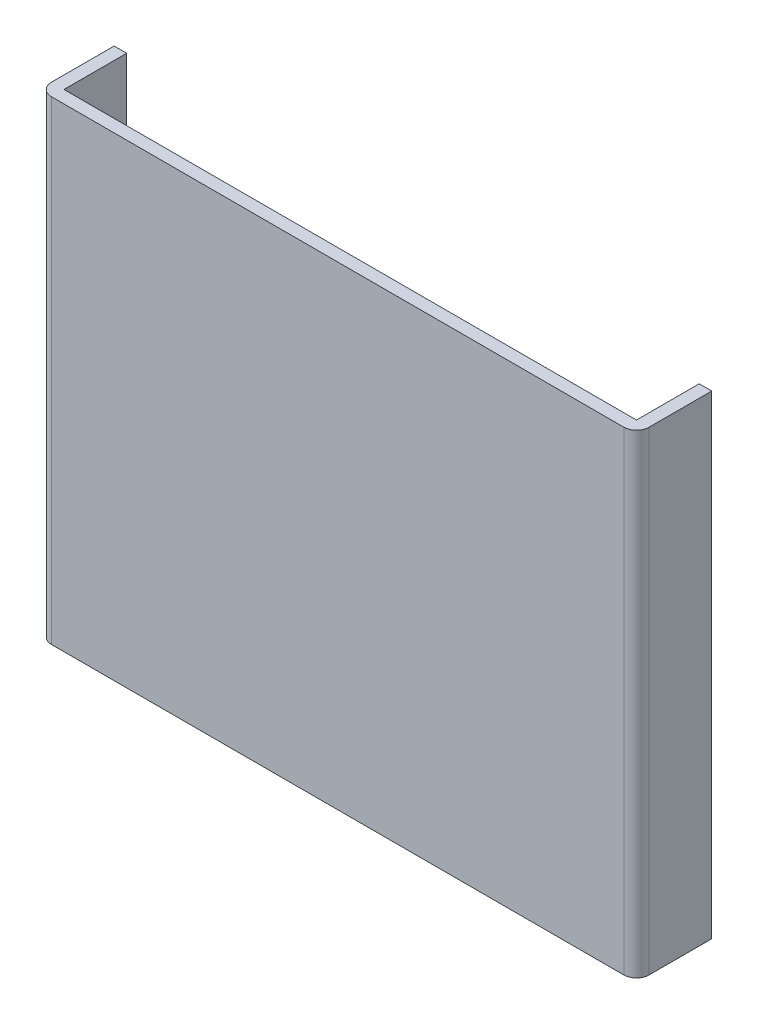
ISO-10303-21;
HEADER;
FILE_DESCRIPTION(('STEP AP214'),'2;1');
FILE_NAME('part.step','',(''),(''),'','','');
FILE_SCHEMA(('AUTOMOTIVE_DESIGN { 1 0 10303 214 1 1 1 1 }'));
ENDSEC;
DATA;
#1=APPLICATION_CONTEXT('core data for automotive mechanical design processes');
#2=APPLICATION_PROTOCOL_DEFINITION('international standard','automotive_design',2000,#1);
#3=PRODUCT_CONTEXT('',#1,'mechanical');
#4=PRODUCT('Part','Part','',(#3));
#5=PRODUCT_RELATED_PRODUCT_CATEGORY('part','',(#4));
#6=PRODUCT_DEFINITION_FORMATION('','',#4);
#7=PRODUCT_DEFINITION_CONTEXT('part definition',#1,'design');
#8=PRODUCT_DEFINITION('design','',#6,#7);
#9=PRODUCT_DEFINITION_SHAPE('','',#8);
#10=(LENGTH_UNIT() NAMED_UNIT(*) SI_UNIT(.MILLI.,.METRE.));
#11=(NAMED_UNIT(*) PLANE_ANGLE_UNIT() SI_UNIT($,.RADIAN.));
#12=(NAMED_UNIT(*) SI_UNIT($,.STERADIAN.) SOLID_ANGLE_UNIT());
#13=UNCERTAINTY_MEASURE_WITH_UNIT(LENGTH_MEASURE(1.E-05),#10,'distance_accuracy_value','');
#14=(GEOMETRIC_REPRESENTATION_CONTEXT(3) GLOBAL_UNCERTAINTY_ASSIGNED_CONTEXT((#13)) GLOBAL_UNIT_ASSIGNED_CONTEXT((#10,
#11,#12)) REPRESENTATION_CONTEXT('',''));
#15=CARTESIAN_POINT('',(0.,0.,0.));
#16=DIRECTION('',(0.,0.,1.));
#17=DIRECTION('',(1.,0.,0.));
#18=AXIS2_PLACEMENT_3D('',#15,#16,#17);
#19=CARTESIAN_POINT('',(-16.6010771137425,75.62,3.56350979413361));
#20=DIRECTION('',(0.,0.,1.));
#21=DIRECTION('',(1.,0.,0.));
#22=AXIS2_PLACEMENT_3D('',#19,#20,#21);
#23=PLANE('',#22);
#24=DIRECTION('',(-1.,0.,0.));
#25=VECTOR('',#24,1.);
#26=CARTESIAN_POINT('',(-16.6010771137425,0.,3.56350979413361));
#27=LINE('',#26,#25);
#28=CARTESIAN_POINT('',(-16.6010771137425,0.,3.56350979413361));
#29=VERTEX_POINT('',#28);
#30=CARTESIAN_POINT('',(-18.6010771137425,0.,3.56350979413361));
#31=VERTEX_POINT('',#30);
#32=EDGE_CURVE('E130',#29,#31,#27,.T.);
#33=ORIENTED_EDGE('',*,*,#32,.T.);
#34=DIRECTION('',(0.,-1.,0.));
#35=VECTOR('',#34,1.);
#36=CARTESIAN_POINT('',(-18.6010771137425,75.62,3.56350979413361));
#37=LINE('',#36,#35);
#38=CARTESIAN_POINT('',(-18.6010771137425,75.62,3.56350979413361));
#39=VERTEX_POINT('',#38);
#40=EDGE_CURVE('E113',#39,#31,#37,.T.);
#41=ORIENTED_EDGE('',*,*,#40,.F.);
#42=DIRECTION('',(-1.,0.,0.));
#43=VECTOR('',#42,1.);
#44=CARTESIAN_POINT('',(-16.6010771137425,75.62,3.56350979413361));
#45=LINE('',#44,#43);
#46=CARTESIAN_POINT('',(-16.6010771137425,75.62,3.56350979413361));
#47=VERTEX_POINT('',#46);
#48=EDGE_CURVE('E118',#47,#39,#45,.T.);
#49=ORIENTED_EDGE('',*,*,#48,.F.);
#50=DIRECTION('',(0.,-1.,0.));
#51=VECTOR('',#50,1.);
#52=CARTESIAN_POINT('',(-16.6010771137425,75.62,3.56350979413361));
#53=LINE('',#52,#51);
#54=EDGE_CURVE('E184',#47,#29,#53,.T.);
#55=ORIENTED_EDGE('',*,*,#54,.T.);
#56=EDGE_LOOP('',(#33,#41,#49,#55));
#57=FACE_BOUND('',#56,.T.);
#58=ADVANCED_FACE('F33',(#57),#23,.F.);
#59=CARTESIAN_POINT('',(-18.6010771137425,75.62,3.56350979413361));
#60=DIRECTION('',(1.,0.,0.));
#61=DIRECTION('',(0.,0.,-1.));
#62=AXIS2_PLACEMENT_3D('',#59,#60,#61);
#63=PLANE('',#62);
#64=DIRECTION('',(0.,0.,1.));
#65=VECTOR('',#64,1.);
#66=CARTESIAN_POINT('',(-18.6010771137425,0.,3.56350979413361));
#67=LINE('',#66,#65);
#68=CARTESIAN_POINT('',(-18.6010771137425,0.,13.5635097941336));
#69=VERTEX_POINT('',#68);
#70=EDGE_CURVE('E171',#31,#69,#67,.T.);
#71=ORIENTED_EDGE('',*,*,#70,.T.);
#72=DIRECTION('',(0.,-1.,0.));
#73=VECTOR('',#72,1.);
#74=CARTESIAN_POINT('',(-18.6010771137425,75.62,13.5635097941336));
#75=LINE('',#74,#73);
#76=CARTESIAN_POINT('',(-18.6010771137425,75.62,13.5635097941336));
#77=VERTEX_POINT('',#76);
#78=EDGE_CURVE('E11',#69,#77,#75,.F.);
#79=ORIENTED_EDGE('',*,*,#78,.T.);
#80=DIRECTION('',(0.,0.,1.));
#81=VECTOR('',#80,1.);
#82=CARTESIAN_POINT('',(-18.6010771137425,75.62,3.56350979413361));
#83=LINE('',#82,#81);
#84=EDGE_CURVE('E109',#39,#77,#83,.T.);
#85=ORIENTED_EDGE('',*,*,#84,.F.);
#86=ORIENTED_EDGE('',*,*,#40,.T.);
#87=EDGE_LOOP('',(#71,#79,#85,#86));
#88=FACE_BOUND('',#87,.T.);
#89=ADVANCED_FACE('F111',(#88),#63,.F.);
#90=CARTESIAN_POINT('',(-18.6010771137425,75.62,15.5635097941336));
#91=DIRECTION('',(0.,0.,-1.));
#92=DIRECTION('',(-1.,0.,0.));
#93=AXIS2_PLACEMENT_3D('',#90,#91,#92);
#94=PLANE('',#93);
#95=DIRECTION('',(1.,0.,0.));
#96=VECTOR('',#95,1.);
#97=CARTESIAN_POINT('',(-18.6010771137425,0.,15.5635097941336));
#98=LINE('',#97,#96);
#99=CARTESIAN_POINT('',(-16.6010771137425,0.,15.5635097941336));
#100=VERTEX_POINT('',#99);
#101=CARTESIAN_POINT('',(74.6589228862575,0.,15.5635097941336));
#102=VERTEX_POINT('',#101);
#103=EDGE_CURVE('E166',#100,#102,#98,.T.);
#104=ORIENTED_EDGE('',*,*,#103,.T.);
#105=DIRECTION('',(0.,-1.,0.));
#106=VECTOR('',#105,1.);
#107=CARTESIAN_POINT('',(74.6589228862575,75.62,15.5635097941336));
#108=LINE('',#107,#106);
#109=CARTESIAN_POINT('',(74.6589228862575,75.62,15.5635097941336));
#110=VERTEX_POINT('',#109);
#111=EDGE_CURVE('E54',#102,#110,#108,.F.);
#112=ORIENTED_EDGE('',*,*,#111,.T.);
#113=DIRECTION('',(1.,0.,0.));
#114=VECTOR('',#113,1.);
#115=CARTESIAN_POINT('',(-18.6010771137425,75.62,15.5635097941336));
#116=LINE('',#115,#114);
#117=CARTESIAN_POINT('',(-16.6010771137425,75.62,15.5635097941336));
#118=VERTEX_POINT('',#117);
#119=EDGE_CURVE('E117',#118,#110,#116,.T.);
#120=ORIENTED_EDGE('',*,*,#119,.F.);
#121=DIRECTION('',(0.,-1.,0.));
#122=VECTOR('',#121,1.);
#123=CARTESIAN_POINT('',(-16.6010771137425,75.62,15.5635097941336));
#124=LINE('',#123,#122);
#125=EDGE_CURVE('E145',#118,#100,#124,.T.);
#126=ORIENTED_EDGE('',*,*,#125,.T.);
#127=EDGE_LOOP('',(#104,#112,#120,#126));
#128=FACE_BOUND('',#127,.T.);
#129=ADVANCED_FACE('F169',(#128),#94,.F.);
#130=CARTESIAN_POINT('',(76.6589228862575,75.62,15.5635097941336));
#131=DIRECTION('',(-1.,0.,0.));
#132=DIRECTION('',(0.,0.,1.));
#133=AXIS2_PLACEMENT_3D('',#130,#131,#132);
#134=PLANE('',#133);
#135=DIRECTION('',(0.,0.,-1.));
#136=VECTOR('',#135,1.);
#137=CARTESIAN_POINT('',(76.6589228862575,75.62,15.5635097941336));
#138=LINE('',#137,#136);
#139=CARTESIAN_POINT('',(76.6589228862575,75.62,13.5635097941336));
#140=VERTEX_POINT('',#139);
#141=CARTESIAN_POINT('',(76.6589228862575,75.62,3.5635097941336));
#142=VERTEX_POINT('',#141);
#143=EDGE_CURVE('E152',#140,#142,#138,.T.);
#144=ORIENTED_EDGE('',*,*,#143,.F.);
#145=DIRECTION('',(0.,-1.,0.));
#146=VECTOR('',#145,1.);
#147=CARTESIAN_POINT('',(76.6589228862575,75.62,13.5635097941336));
#148=LINE('',#147,#146);
#149=CARTESIAN_POINT('',(76.6589228862575,0.,13.5635097941336));
#150=VERTEX_POINT('',#149);
#151=EDGE_CURVE('E131',#140,#150,#148,.T.);
#152=ORIENTED_EDGE('',*,*,#151,.T.);
#153=DIRECTION('',(0.,0.,-1.));
#154=VECTOR('',#153,1.);
#155=CARTESIAN_POINT('',(76.6589228862575,0.,15.5635097941336));
#156=LINE('',#155,#154);
#157=CARTESIAN_POINT('',(76.6589228862575,0.,3.5635097941336));
#158=VERTEX_POINT('',#157);
#159=EDGE_CURVE('E168',#150,#158,#156,.T.);
#160=ORIENTED_EDGE('',*,*,#159,.T.);
#161=DIRECTION('',(0.,-1.,0.));
#162=VECTOR('',#161,1.);
#163=CARTESIAN_POINT('',(76.6589228862575,75.62,3.5635097941336));
#164=LINE('',#163,#162);
#165=EDGE_CURVE('E132',#142,#158,#164,.T.);
#166=ORIENTED_EDGE('',*,*,#165,.F.);
#167=EDGE_LOOP('',(#144,#152,#160,#166));
#168=FACE_BOUND('',#167,.T.);
#169=ADVANCED_FACE('F157',(#168),#134,.F.);
#170=CARTESIAN_POINT('',(76.6589228862575,75.62,3.5635097941336));
#171=DIRECTION('',(0.,0.,1.));
#172=DIRECTION('',(1.,0.,0.));
#173=AXIS2_PLACEMENT_3D('',#170,#171,#172);
#174=PLANE('',#173);
#175=DIRECTION('',(-1.,0.,0.));
#176=VECTOR('',#175,1.);
#177=CARTESIAN_POINT('',(76.6589228862575,0.,3.5635097941336));
#178=LINE('',#177,#176);
#179=CARTESIAN_POINT('',(74.6589228862575,0.,3.5635097941336));
#180=VERTEX_POINT('',#179);
#181=EDGE_CURVE('E173',#158,#180,#178,.T.);
#182=ORIENTED_EDGE('',*,*,#181,.T.);
#183=DIRECTION('',(0.,-1.,0.));
#184=VECTOR('',#183,1.);
#185=CARTESIAN_POINT('',(74.6589228862575,75.62,3.5635097941336));
#186=LINE('',#185,#184);
#187=CARTESIAN_POINT('',(74.6589228862575,75.62,3.5635097941336));
#188=VERTEX_POINT('',#187);
#189=EDGE_CURVE('E138',#188,#180,#186,.T.);
#190=ORIENTED_EDGE('',*,*,#189,.F.);
#191=DIRECTION('',(-1.,0.,0.));
#192=VECTOR('',#191,1.);
#193=CARTESIAN_POINT('',(76.6589228862575,75.62,3.5635097941336));
#194=LINE('',#193,#192);
#195=EDGE_CURVE('E160',#142,#188,#194,.T.);
#196=ORIENTED_EDGE('',*,*,#195,.F.);
#197=ORIENTED_EDGE('',*,*,#165,.T.);
#198=EDGE_LOOP('',(#182,#190,#196,#197));
#199=FACE_BOUND('',#198,.T.);
#200=ADVANCED_FACE('F214',(#199),#174,.F.);
#201=CARTESIAN_POINT('',(74.6589228862575,75.62,3.5635097941336));
#202=DIRECTION('',(1.,0.,0.));
#203=DIRECTION('',(0.,0.,-1.));
#204=AXIS2_PLACEMENT_3D('',#201,#202,#203);
#205=PLANE('',#204);
#206=DIRECTION('',(0.,0.,1.));
#207=VECTOR('',#206,1.);
#208=CARTESIAN_POINT('',(74.6589228862575,0.,3.5635097941336));
#209=LINE('',#208,#207);
#210=CARTESIAN_POINT('',(74.6589228862575,0.,13.5635097941336));
#211=VERTEX_POINT('',#210);
#212=EDGE_CURVE('E179',#180,#211,#209,.T.);
#213=ORIENTED_EDGE('',*,*,#212,.T.);
#214=DIRECTION('',(0.,-1.,0.));
#215=VECTOR('',#214,1.);
#216=CARTESIAN_POINT('',(74.6589228862575,75.62,13.5635097941336));
#217=LINE('',#216,#215);
#218=CARTESIAN_POINT('',(74.6589228862575,75.62,13.5635097941336));
#219=VERTEX_POINT('',#218);
#220=EDGE_CURVE('E189',#219,#211,#217,.T.);
#221=ORIENTED_EDGE('',*,*,#220,.F.);
#222=DIRECTION('',(0.,0.,1.));
#223=VECTOR('',#222,1.);
#224=CARTESIAN_POINT('',(74.6589228862575,75.62,3.5635097941336));
#225=LINE('',#224,#223);
#226=EDGE_CURVE('E198',#188,#219,#225,.T.);
#227=ORIENTED_EDGE('',*,*,#226,.F.);
#228=ORIENTED_EDGE('',*,*,#189,.T.);
#229=EDGE_LOOP('',(#213,#221,#227,#228));
#230=FACE_BOUND('',#229,.T.);
#231=ADVANCED_FACE('F196',(#230),#205,.F.);
#232=CARTESIAN_POINT('',(74.6589228862575,75.62,13.5635097941336));
#233=DIRECTION('',(0.,0.,1.));
#234=DIRECTION('',(1.,0.,0.));
#235=AXIS2_PLACEMENT_3D('',#232,#233,#234);
#236=PLANE('',#235);
#237=DIRECTION('',(-1.,0.,0.));
#238=VECTOR('',#237,1.);
#239=CARTESIAN_POINT('',(74.6589228862575,0.,13.5635097941336));
#240=LINE('',#239,#238);
#241=CARTESIAN_POINT('',(-16.6010771137425,0.,13.5635097941336));
#242=VERTEX_POINT('',#241);
#243=EDGE_CURVE('E181',#211,#242,#240,.T.);
#244=ORIENTED_EDGE('',*,*,#243,.T.);
#245=DIRECTION('',(0.,-1.,0.));
#246=VECTOR('',#245,1.);
#247=CARTESIAN_POINT('',(-16.6010771137425,75.62,13.5635097941336));
#248=LINE('',#247,#246);
#249=CARTESIAN_POINT('',(-16.6010771137425,75.62,13.5635097941336));
#250=VERTEX_POINT('',#249);
#251=EDGE_CURVE('E186',#250,#242,#248,.T.);
#252=ORIENTED_EDGE('',*,*,#251,.F.);
#253=DIRECTION('',(-1.,0.,0.));
#254=VECTOR('',#253,1.);
#255=CARTESIAN_POINT('',(74.6589228862575,75.62,13.5635097941336));
#256=LINE('',#255,#254);
#257=EDGE_CURVE('E208',#219,#250,#256,.T.);
#258=ORIENTED_EDGE('',*,*,#257,.F.);
#259=ORIENTED_EDGE('',*,*,#220,.T.);
#260=EDGE_LOOP('',(#244,#252,#258,#259));
#261=FACE_BOUND('',#260,.T.);
#262=ADVANCED_FACE('F204',(#261),#236,.F.);
#263=CARTESIAN_POINT('',(-16.6010771137425,75.62,13.5635097941336));
#264=DIRECTION('',(-1.,0.,0.));
#265=DIRECTION('',(0.,0.,1.));
#266=AXIS2_PLACEMENT_3D('',#263,#264,#265);
#267=PLANE('',#266);
#268=DIRECTION('',(0.,0.,-1.));
#269=VECTOR('',#268,1.);
#270=CARTESIAN_POINT('',(-16.6010771137425,0.,13.5635097941336));
#271=LINE('',#270,#269);
#272=EDGE_CURVE('E127',#242,#29,#271,.T.);
#273=ORIENTED_EDGE('',*,*,#272,.T.);
#274=ORIENTED_EDGE('',*,*,#54,.F.);
#275=DIRECTION('',(0.,0.,-1.));
#276=VECTOR('',#275,1.);
#277=CARTESIAN_POINT('',(-16.6010771137425,75.62,13.5635097941336));
#278=LINE('',#277,#276);
#279=EDGE_CURVE('E123',#250,#47,#278,.T.);
#280=ORIENTED_EDGE('',*,*,#279,.F.);
#281=ORIENTED_EDGE('',*,*,#251,.T.);
#282=EDGE_LOOP('',(#273,#274,#280,#281));
#283=FACE_BOUND('',#282,.T.);
#284=ADVANCED_FACE('F207',(#283),#267,.F.);
#285=CARTESIAN_POINT('',(0.,75.62,0.));
#286=DIRECTION('',(0.,1.,0.));
#287=DIRECTION('',(0.,0.,1.));
#288=AXIS2_PLACEMENT_3D('',#285,#286,#287);
#289=PLANE('',#288);
#290=ORIENTED_EDGE('',*,*,#119,.T.);
#291=CARTESIAN_POINT('',(74.6589228862575,75.62,13.5635097941336));
#292=DIRECTION('',(0.,1.,0.));
#293=DIRECTION('',(0.,0.,1.));
#294=AXIS2_PLACEMENT_3D('',#291,#292,#293);
#295=CIRCLE('',#294,2.);
#296=EDGE_CURVE('E41',#110,#140,#295,.T.);
#297=ORIENTED_EDGE('',*,*,#296,.T.);
#298=ORIENTED_EDGE('',*,*,#143,.T.);
#299=ORIENTED_EDGE('',*,*,#195,.T.);
#300=ORIENTED_EDGE('',*,*,#226,.T.);
#301=ORIENTED_EDGE('',*,*,#257,.T.);
#302=ORIENTED_EDGE('',*,*,#279,.T.);
#303=ORIENTED_EDGE('',*,*,#48,.T.);
#304=ORIENTED_EDGE('',*,*,#84,.T.);
#305=CARTESIAN_POINT('',(-16.6010771137425,75.62,13.5635097941336));
#306=DIRECTION('',(0.,1.,0.));
#307=DIRECTION('',(0.,0.,1.));
#308=AXIS2_PLACEMENT_3D('',#305,#306,#307);
#309=CIRCLE('',#308,2.);
#310=EDGE_CURVE('E149',#77,#118,#309,.T.);
#311=ORIENTED_EDGE('',*,*,#310,.T.);
#312=EDGE_LOOP('',(#290,#297,#298,#299,#300,#301,#302,#303,#304,#311));
#313=FACE_BOUND('',#312,.T.);
#314=ADVANCED_FACE('F121',(#313),#289,.T.);
#315=CARTESIAN_POINT('',(0.,0.,0.));
#316=DIRECTION('',(0.,1.,0.));
#317=DIRECTION('',(0.,0.,1.));
#318=AXIS2_PLACEMENT_3D('',#315,#316,#317);
#319=PLANE('',#318);
#320=ORIENTED_EDGE('',*,*,#159,.F.);
#321=CARTESIAN_POINT('',(74.6589228862575,0.,13.5635097941336));
#322=DIRECTION('',(0.,1.,0.));
#323=DIRECTION('',(0.,0.,1.));
#324=AXIS2_PLACEMENT_3D('',#321,#322,#323);
#325=CIRCLE('',#324,2.);
#326=EDGE_CURVE('E143',#150,#102,#325,.F.);
#327=ORIENTED_EDGE('',*,*,#326,.T.);
#328=ORIENTED_EDGE('',*,*,#103,.F.);
#329=CARTESIAN_POINT('',(-16.6010771137425,0.,13.5635097941336));
#330=DIRECTION('',(0.,1.,0.));
#331=DIRECTION('',(0.,0.,1.));
#332=AXIS2_PLACEMENT_3D('',#329,#330,#331);
#333=CIRCLE('',#332,2.);
#334=EDGE_CURVE('E135',#100,#69,#333,.F.);
#335=ORIENTED_EDGE('',*,*,#334,.T.);
#336=ORIENTED_EDGE('',*,*,#70,.F.);
#337=ORIENTED_EDGE('',*,*,#32,.F.);
#338=ORIENTED_EDGE('',*,*,#272,.F.);
#339=ORIENTED_EDGE('',*,*,#243,.F.);
#340=ORIENTED_EDGE('',*,*,#212,.F.);
#341=ORIENTED_EDGE('',*,*,#181,.F.);
#342=EDGE_LOOP('',(#320,#327,#328,#335,#336,#337,#338,#339,#340,#341));
#343=FACE_BOUND('',#342,.T.);
#344=ADVANCED_FACE('F165',(#343),#319,.F.);
#345=CARTESIAN_POINT('',(74.6589228862575,75.62,13.5635097941336));
#346=DIRECTION('',(0.,-1.,0.));
#347=DIRECTION('',(0.,0.,-1.));
#348=AXIS2_PLACEMENT_3D('',#345,#346,#347);
#349=CYLINDRICAL_SURFACE('',#348,2.);
#350=ORIENTED_EDGE('',*,*,#296,.F.);
#351=ORIENTED_EDGE('',*,*,#111,.F.);
#352=ORIENTED_EDGE('',*,*,#326,.F.);
#353=ORIENTED_EDGE('',*,*,#151,.F.);
#354=EDGE_LOOP('',(#350,#351,#352,#353));
#355=FACE_BOUND('',#354,.T.);
#356=ADVANCED_FACE('F162',(#355),#349,.T.);
#357=CARTESIAN_POINT('',(-16.6010771137425,75.62,13.5635097941336));
#358=DIRECTION('',(0.,-1.,0.));
#359=DIRECTION('',(0.,0.,-1.));
#360=AXIS2_PLACEMENT_3D('',#357,#358,#359);
#361=CYLINDRICAL_SURFACE('',#360,2.);
#362=ORIENTED_EDGE('',*,*,#310,.F.);
#363=ORIENTED_EDGE('',*,*,#78,.F.);
#364=ORIENTED_EDGE('',*,*,#334,.F.);
#365=ORIENTED_EDGE('',*,*,#125,.F.);
#366=EDGE_LOOP('',(#362,#363,#364,#365));
#367=FACE_BOUND('',#366,.T.);
#368=ADVANCED_FACE('F35',(#367),#361,.T.);
#369=CLOSED_SHELL('',(#58,#89,#129,#169,#200,#231,#262,#284,#314,#344,#356,#368));
#370=MANIFOLD_SOLID_BREP('B2',#369);
#371=ADVANCED_BREP_SHAPE_REPRESENTATION('',(#18,#370),#14);
#372=SHAPE_DEFINITION_REPRESENTATION(#9,#371);
ENDSEC;
END-ISO-10303-21;
